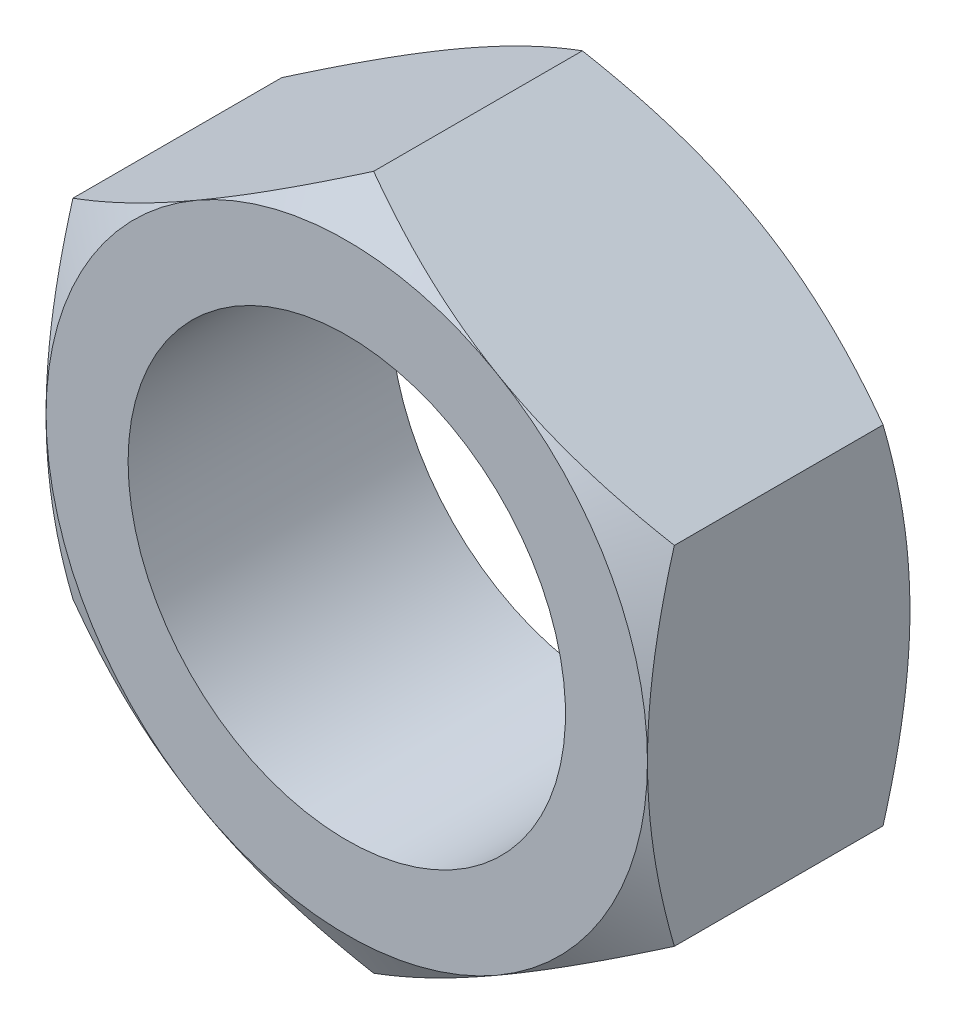
ISO-10303-21;
HEADER;
FILE_DESCRIPTION(('STEP AP214'),'2;1');
FILE_NAME('part.step','',(''),(''),'','','');
FILE_SCHEMA(('AUTOMOTIVE_DESIGN { 1 0 10303 214 1 1 1 1 }'));
ENDSEC;
DATA;
#1=APPLICATION_CONTEXT('core data for automotive mechanical design processes');
#2=APPLICATION_PROTOCOL_DEFINITION('international standard','automotive_design',2000,#1);
#3=PRODUCT_CONTEXT('',#1,'mechanical');
#4=PRODUCT('Part','Part','',(#3));
#5=PRODUCT_RELATED_PRODUCT_CATEGORY('part','',(#4));
#6=PRODUCT_DEFINITION_FORMATION('','',#4);
#7=PRODUCT_DEFINITION_CONTEXT('part definition',#1,'design');
#8=PRODUCT_DEFINITION('design','',#6,#7);
#9=PRODUCT_DEFINITION_SHAPE('','',#8);
#10=(LENGTH_UNIT() NAMED_UNIT(*) SI_UNIT(.MILLI.,.METRE.));
#11=(NAMED_UNIT(*) PLANE_ANGLE_UNIT() SI_UNIT($,.RADIAN.));
#12=(NAMED_UNIT(*) SI_UNIT($,.STERADIAN.) SOLID_ANGLE_UNIT());
#13=UNCERTAINTY_MEASURE_WITH_UNIT(LENGTH_MEASURE(1.E-05),#10,'distance_accuracy_value','');
#14=(GEOMETRIC_REPRESENTATION_CONTEXT(3) GLOBAL_UNCERTAINTY_ASSIGNED_CONTEXT((#13)) GLOBAL_UNIT_ASSIGNED_CONTEXT((#10,
#11,#12)) REPRESENTATION_CONTEXT('',''));
#15=CARTESIAN_POINT('',(0.,0.,0.));
#16=DIRECTION('',(0.,0.,1.));
#17=DIRECTION('',(1.,0.,0.));
#18=AXIS2_PLACEMENT_3D('',#15,#16,#17);
#19=CARTESIAN_POINT('',(0.,3.17542648054295,-2.4));
#20=DIRECTION('',(0.,0.,-1.));
#21=DIRECTION('',(-1.,0.,0.));
#22=AXIS2_PLACEMENT_3D('',#19,#20,#21);
#23=PLANE('',#22);
#24=CARTESIAN_POINT('',(0.,0.,-2.4));
#25=DIRECTION('',(0.,0.,-1.));
#26=DIRECTION('',(-1.,0.,0.));
#27=AXIS2_PLACEMENT_3D('',#24,#25,#26);
#28=CIRCLE('',#27,2.);
#29=CARTESIAN_POINT('',(-2.,0.,-2.4));
#30=VERTEX_POINT('',#29);
#31=EDGE_CURVE('E326',#30,#30,#28,.T.);
#32=ORIENTED_EDGE('',*,*,#31,.F.);
#33=EDGE_LOOP('',(#32));
#34=FACE_BOUND('',#33,.T.);
#35=CARTESIAN_POINT('',(0.,0.,-2.4));
#36=DIRECTION('',(0.,0.,-1.));
#37=DIRECTION('',(-1.,0.,0.));
#38=AXIS2_PLACEMENT_3D('',#35,#36,#37);
#39=CIRCLE('',#38,2.75);
#40=CARTESIAN_POINT('',(-2.75,0.,-2.4));
#41=VERTEX_POINT('',#40);
#42=CARTESIAN_POINT('',(-1.37500000000002,-2.3815698604072,-2.4));
#43=VERTEX_POINT('',#42);
#44=EDGE_CURVE('E180',#41,#43,#39,.F.);
#45=ORIENTED_EDGE('',*,*,#44,.F.);
#46=CARTESIAN_POINT('',(-1.37500000000001,2.3815698604072,-2.4));
#47=VERTEX_POINT('',#46);
#48=EDGE_CURVE('E162',#47,#41,#39,.F.);
#49=ORIENTED_EDGE('',*,*,#48,.F.);
#50=CARTESIAN_POINT('',(1.37500000000002,2.38156986040719,-2.4));
#51=VERTEX_POINT('',#50);
#52=EDGE_CURVE('E179',#51,#47,#39,.F.);
#53=ORIENTED_EDGE('',*,*,#52,.F.);
#54=CARTESIAN_POINT('',(0.,0.,-2.4));
#55=DIRECTION('',(0.,0.,1.));
#56=DIRECTION('',(1.,0.,0.));
#57=AXIS2_PLACEMENT_3D('',#54,#55,#56);
#58=CIRCLE('',#57,2.75);
#59=CARTESIAN_POINT('',(2.75,0.,-2.4));
#60=VERTEX_POINT('',#59);
#61=EDGE_CURVE('E314',#60,#51,#58,.T.);
#62=ORIENTED_EDGE('',*,*,#61,.F.);
#63=CARTESIAN_POINT('',(1.375,-2.3815698604072,-2.4));
#64=VERTEX_POINT('',#63);
#65=EDGE_CURVE('E194',#64,#60,#39,.F.);
#66=ORIENTED_EDGE('',*,*,#65,.F.);
#67=EDGE_CURVE('E189',#43,#64,#39,.F.);
#68=ORIENTED_EDGE('',*,*,#67,.F.);
#69=EDGE_LOOP('',(#45,#49,#53,#62,#66,#68));
#70=FACE_BOUND('',#69,.T.);
#71=ADVANCED_FACE('F45',(#34,#70),#23,.T.);
#72=CARTESIAN_POINT('',(0.,3.17542648054295,0.));
#73=DIRECTION('',(0.,0.,-1.));
#74=DIRECTION('',(-1.,0.,0.));
#75=AXIS2_PLACEMENT_3D('',#72,#73,#74);
#76=PLANE('',#75);
#77=CARTESIAN_POINT('',(0.,0.,0.));
#78=DIRECTION('',(0.,0.,-1.));
#79=DIRECTION('',(-1.,0.,0.));
#80=AXIS2_PLACEMENT_3D('',#77,#78,#79);
#81=CIRCLE('',#80,2.);
#82=CARTESIAN_POINT('',(-2.,0.,0.));
#83=VERTEX_POINT('',#82);
#84=EDGE_CURVE('E50',#83,#83,#81,.T.);
#85=ORIENTED_EDGE('',*,*,#84,.T.);
#86=EDGE_LOOP('',(#85));
#87=FACE_BOUND('',#86,.T.);
#88=CARTESIAN_POINT('',(0.,0.,0.));
#89=DIRECTION('',(0.,0.,-1.));
#90=DIRECTION('',(-1.,0.,0.));
#91=AXIS2_PLACEMENT_3D('',#88,#89,#90);
#92=CIRCLE('',#91,2.75);
#93=CARTESIAN_POINT('',(-2.75,0.,0.));
#94=VERTEX_POINT('',#93);
#95=CARTESIAN_POINT('',(-1.37500000000001,2.3815698604072,0.));
#96=VERTEX_POINT('',#95);
#97=EDGE_CURVE('E11',#94,#96,#92,.T.);
#98=ORIENTED_EDGE('',*,*,#97,.F.);
#99=CARTESIAN_POINT('',(-1.37500000000002,-2.3815698604072,0.));
#100=VERTEX_POINT('',#99);
#101=EDGE_CURVE('E56',#100,#94,#92,.T.);
#102=ORIENTED_EDGE('',*,*,#101,.F.);
#103=CARTESIAN_POINT('',(1.375,-2.3815698604072,0.));
#104=VERTEX_POINT('',#103);
#105=EDGE_CURVE('E182',#104,#100,#92,.T.);
#106=ORIENTED_EDGE('',*,*,#105,.F.);
#107=CARTESIAN_POINT('',(2.75,0.,0.));
#108=VERTEX_POINT('',#107);
#109=EDGE_CURVE('E187',#108,#104,#92,.T.);
#110=ORIENTED_EDGE('',*,*,#109,.F.);
#111=CARTESIAN_POINT('',(0.,0.,0.));
#112=DIRECTION('',(0.,0.,1.));
#113=DIRECTION('',(1.,0.,0.));
#114=AXIS2_PLACEMENT_3D('',#111,#112,#113);
#115=CIRCLE('',#114,2.75);
#116=CARTESIAN_POINT('',(1.37500000000002,2.38156986040719,0.));
#117=VERTEX_POINT('',#116);
#118=EDGE_CURVE('E138',#108,#117,#115,.T.);
#119=ORIENTED_EDGE('',*,*,#118,.T.);
#120=EDGE_CURVE('E55',#96,#117,#92,.T.);
#121=ORIENTED_EDGE('',*,*,#120,.F.);
#122=EDGE_LOOP('',(#98,#102,#106,#110,#119,#121));
#123=FACE_BOUND('',#122,.T.);
#124=ADVANCED_FACE('F248',(#87,#123),#76,.F.);
#125=CARTESIAN_POINT('',(0.,3.17542648054295,-2.4));
#126=DIRECTION('',(-0.500000000000004,0.866025403784436,0.));
#127=DIRECTION('',(-0.866025403784437,-0.500000000000004,0.));
#128=AXIS2_PLACEMENT_3D('',#125,#126,#127);
#129=PLANE('',#128);
#130=DIRECTION('',(0.,0.,1.));
#131=VECTOR('',#130,1.);
#132=CARTESIAN_POINT('',(-2.75,1.58771324027146,-2.4));
#133=LINE('',#132,#131);
#134=CARTESIAN_POINT('',(-2.75,1.58771324027149,-2.15437990693813));
#135=VERTEX_POINT('',#134);
#136=CARTESIAN_POINT('',(-2.75,1.58771324027146,-0.245620093061863));
#137=VERTEX_POINT('',#136);
#138=EDGE_CURVE('E174',#135,#137,#133,.T.);
#139=ORIENTED_EDGE('',*,*,#138,.T.);
#140=CARTESIAN_POINT('',(-2.7502,1.58759777021762,-0.245686763364762));
#141=CARTESIAN_POINT('',(-2.62935077934009,1.65737010029698,-0.205387662249264));
#142=CARTESIAN_POINT('',(-2.50745839737737,1.72774469983532,-0.168736902597662));
#143=CARTESIAN_POINT('',(-2.26156287327211,1.86971254687002,-0.1047621829698));
#144=CARTESIAN_POINT('',(-2.13755536142614,1.94130831721582,-0.0774608556744958));
#145=CARTESIAN_POINT('',(-1.89107720202406,2.08361254889598,-0.0349617452941147));
#146=CARTESIAN_POINT('',(-1.76864448141258,2.15429911309863,-0.0194811186224557));
#147=CARTESIAN_POINT('',(-1.52320285763109,2.29600490065922,-0.000999397369938647));
#148=CARTESIAN_POINT('',(-1.40019484676709,2.36702360884403,0.00201700053740192));
#149=CARTESIAN_POINT('',(-1.17034121338921,2.49972966594897,-0.0042531454285456));
#150=CARTESIAN_POINT('',(-1.06346120874598,2.56143686540072,-0.0120001542767017));
#151=CARTESIAN_POINT('',(-0.850397532665248,2.68444923614047,-0.0365551810643555));
#152=CARTESIAN_POINT('',(-0.744214598351108,2.74575398185008,-0.0533715896505721));
#153=CARTESIAN_POINT('',(-0.530711510606812,2.86902004703207,-0.0954119223459602));
#154=CARTESIAN_POINT('',(-0.423418383857139,2.93096576264319,-0.120814080687236));
#155=CARTESIAN_POINT('',(-0.210432520715941,3.05393320806134,-0.178467225839989));
#156=CARTESIAN_POINT('',(-0.104737054973339,3.11495651365996,-0.210704663298991));
#157=CARTESIAN_POINT('',(0.000200000000009052,3.17554195059679,-0.245686763364771));
#158=B_SPLINE_CURVE_WITH_KNOTS('',3,(#140,#141,#142,#143,#144,#145,#146,#147,#148,#149,#150,
#151,#152,#153,#154,#155,#156,#157),.UNSPECIFIED.,.F.,.F.,(4,2,2,2,2,2,2,2,4),(0.,
0.435912828725888,0.872873557116333,1.29901931904672,1.72464171213574,2.09526089052938,
2.46622354066375,2.84541551798559,3.22386274754526),.UNSPECIFIED.);
#159=EDGE_CURVE('E143',#137,#96,#158,.T.);
#160=ORIENTED_EDGE('',*,*,#159,.T.);
#161=CARTESIAN_POINT('',(0.,3.17542648054295,-0.245620093061873));
#162=VERTEX_POINT('',#161);
#163=EDGE_CURVE('E63',#96,#162,#158,.T.);
#164=ORIENTED_EDGE('',*,*,#163,.T.);
#165=DIRECTION('',(0.,0.,1.));
#166=VECTOR('',#165,1.);
#167=CARTESIAN_POINT('',(0.,3.17542648054295,-2.4));
#168=LINE('',#167,#166);
#169=CARTESIAN_POINT('',(0.,3.17542648054295,-2.15437990693813));
#170=VERTEX_POINT('',#169);
#171=EDGE_CURVE('E159',#170,#162,#168,.T.);
#172=ORIENTED_EDGE('',*,*,#171,.F.);
#173=CARTESIAN_POINT('',(-2.7502,1.58759777021762,-2.15431323663524));
#174=CARTESIAN_POINT('',(-2.62935077934009,1.65737010029698,-2.19461233775074));
#175=CARTESIAN_POINT('',(-2.50745839737737,1.72774469983532,-2.23126309740234));
#176=CARTESIAN_POINT('',(-2.26156287327211,1.86971254687002,-2.2952378170302));
#177=CARTESIAN_POINT('',(-2.13755536142614,1.94130831721582,-2.3225391443255));
#178=CARTESIAN_POINT('',(-1.89107720202406,2.08361254889598,-2.36503825470588));
#179=CARTESIAN_POINT('',(-1.76864448141258,2.15429911309863,-2.38051888137754));
#180=CARTESIAN_POINT('',(-1.52320285763109,2.29600490065922,-2.39900060263006));
#181=CARTESIAN_POINT('',(-1.40019484676709,2.36702360884403,-2.4020170005374));
#182=CARTESIAN_POINT('',(-1.17034121338921,2.49972966594897,-2.39574685457145));
#183=CARTESIAN_POINT('',(-1.06346120874598,2.56143686540072,-2.3879998457233));
#184=CARTESIAN_POINT('',(-0.850397532665248,2.68444923614047,-2.36344481893564));
#185=CARTESIAN_POINT('',(-0.744214598351108,2.74575398185008,-2.34662841034943));
#186=CARTESIAN_POINT('',(-0.530711510606812,2.86902004703207,-2.30458807765404));
#187=CARTESIAN_POINT('',(-0.423418383857139,2.93096576264319,-2.27918591931276));
#188=CARTESIAN_POINT('',(-0.210432520715941,3.05393320806134,-2.22153277416001));
#189=CARTESIAN_POINT('',(-0.104737054973339,3.11495651365996,-2.18929533670101));
#190=CARTESIAN_POINT('',(0.00020000000000905,3.17554195059679,-2.15431323663523));
#191=B_SPLINE_CURVE_WITH_KNOTS('',3,(#173,#174,#175,#176,#177,#178,#179,#180,#181,#182,#183,
#184,#185,#186,#187,#188,#189,#190),.UNSPECIFIED.,.F.,.F.,(4,2,2,2,2,2,2,2,4),(0.,
0.435912828725889,0.872873557116333,1.29901931904672,1.72464171213574,2.09526089052938,
2.46622354066375,2.84541551798559,3.22386274754526),.UNSPECIFIED.);
#192=EDGE_CURVE('E177',#47,#170,#191,.T.);
#193=ORIENTED_EDGE('',*,*,#192,.F.);
#194=EDGE_CURVE('E212',#135,#47,#191,.T.);
#195=ORIENTED_EDGE('',*,*,#194,.F.);
#196=EDGE_LOOP('',(#139,#160,#164,#172,#193,#195));
#197=FACE_BOUND('',#196,.T.);
#198=ADVANCED_FACE('F47',(#197),#129,.T.);
#199=CARTESIAN_POINT('',(2.75,1.58771324027145,-2.4));
#200=DIRECTION('',(0.500000000000009,0.866025403784433,0.));
#201=DIRECTION('',(-0.866025403784434,0.500000000000009,0.));
#202=AXIS2_PLACEMENT_3D('',#199,#200,#201);
#203=PLANE('',#202);
#204=ORIENTED_EDGE('',*,*,#171,.T.);
#205=CARTESIAN_POINT('',(-0.000199999999990853,3.17554195059679,-0.245686763364771));
#206=CARTESIAN_POINT('',(0.120649220659915,3.10576962051743,-0.205387662249272));
#207=CARTESIAN_POINT('',(0.242541602622642,3.03539502097909,-0.16873690259767));
#208=CARTESIAN_POINT('',(0.488437126727901,2.89342717394439,-0.104762182969806));
#209=CARTESIAN_POINT('',(0.612444638573863,2.82183140359859,-0.0774608556745011));
#210=CARTESIAN_POINT('',(0.858922797975952,2.67952717191842,-0.0349617452941182));
#211=CARTESIAN_POINT('',(0.981355518587425,2.60884060771577,-0.0194811186224581));
#212=CARTESIAN_POINT('',(1.22679714236892,2.46713482015518,-0.000999397369939154));
#213=CARTESIAN_POINT('',(1.34980515323292,2.39611611197037,0.00201700053740218));
#214=CARTESIAN_POINT('',(1.5796587866108,2.26341005486543,-0.00425314542854392));
#215=CARTESIAN_POINT('',(1.68653879125403,2.20170285541367,-0.0120001542766992));
#216=CARTESIAN_POINT('',(1.89960246733476,2.07869048467393,-0.0365551810643514));
#217=CARTESIAN_POINT('',(2.00578540164889,2.01738573896432,-0.053371589650567));
#218=CARTESIAN_POINT('',(2.21928848939319,1.89411967378233,-0.0954119223459534));
#219=CARTESIAN_POINT('',(2.32658161614286,1.83217395817121,-0.120814080687228));
#220=CARTESIAN_POINT('',(2.53956747928405,1.70920651275305,-0.17846722583998));
#221=CARTESIAN_POINT('',(2.64526294502666,1.64818320715444,-0.210704663298981));
#222=CARTESIAN_POINT('',(2.7502,1.58759777021761,-0.245686763364759));
#223=B_SPLINE_CURVE_WITH_KNOTS('',3,(#205,#206,#207,#208,#209,#210,#211,#212,#213,#214,#215,
#216,#217,#218,#219,#220,#221,#222),.UNSPECIFIED.,.F.,.F.,(4,2,2,2,2,2,2,2,4),(0.,
0.435912828725891,0.872873557116338,1.29901931904672,1.72464171213575,2.09526089052939,
2.46622354066375,2.84541551798559,3.22386274754526),.UNSPECIFIED.);
#224=EDGE_CURVE('E153',#162,#117,#223,.T.);
#225=ORIENTED_EDGE('',*,*,#224,.T.);
#226=CARTESIAN_POINT('',(2.75,1.58771324027149,-0.245620093061873));
#227=VERTEX_POINT('',#226);
#228=EDGE_CURVE('E70',#117,#227,#223,.T.);
#229=ORIENTED_EDGE('',*,*,#228,.T.);
#230=DIRECTION('',(0.,0.,1.));
#231=VECTOR('',#230,1.);
#232=CARTESIAN_POINT('',(2.75,1.58771324027145,-2.4));
#233=LINE('',#232,#231);
#234=CARTESIAN_POINT('',(2.75,1.58771324027149,-2.15437990693813));
#235=VERTEX_POINT('',#234);
#236=EDGE_CURVE('E152',#235,#227,#233,.T.);
#237=ORIENTED_EDGE('',*,*,#236,.F.);
#238=CARTESIAN_POINT('',(-0.000199999999990853,3.17554195059679,-2.15431323663523));
#239=CARTESIAN_POINT('',(0.120649220659915,3.10576962051743,-2.19461233775073));
#240=CARTESIAN_POINT('',(0.242541602622642,3.03539502097909,-2.23126309740233));
#241=CARTESIAN_POINT('',(0.488437126727901,2.89342717394439,-2.29523781703019));
#242=CARTESIAN_POINT('',(0.612444638573863,2.82183140359859,-2.3225391443255));
#243=CARTESIAN_POINT('',(0.858922797975952,2.67952717191842,-2.36503825470588));
#244=CARTESIAN_POINT('',(0.981355518587425,2.60884060771577,-2.38051888137754));
#245=CARTESIAN_POINT('',(1.22679714236892,2.46713482015518,-2.39900060263006));
#246=CARTESIAN_POINT('',(1.34980515323292,2.39611611197037,-2.4020170005374));
#247=CARTESIAN_POINT('',(1.5796587866108,2.26341005486543,-2.39574685457146));
#248=CARTESIAN_POINT('',(1.68653879125403,2.20170285541367,-2.3879998457233));
#249=CARTESIAN_POINT('',(1.89960246733476,2.07869048467393,-2.36344481893565));
#250=CARTESIAN_POINT('',(2.00578540164889,2.01738573896432,-2.34662841034943));
#251=CARTESIAN_POINT('',(2.21928848939319,1.89411967378233,-2.30458807765405));
#252=CARTESIAN_POINT('',(2.32658161614286,1.83217395817121,-2.27918591931277));
#253=CARTESIAN_POINT('',(2.53956747928406,1.70920651275305,-2.22153277416002));
#254=CARTESIAN_POINT('',(2.64526294502666,1.64818320715444,-2.18929533670102));
#255=CARTESIAN_POINT('',(2.7502,1.58759777021761,-2.15431323663524));
#256=B_SPLINE_CURVE_WITH_KNOTS('',3,(#238,#239,#240,#241,#242,#243,#244,#245,#246,#247,#248,
#249,#250,#251,#252,#253,#254,#255),.UNSPECIFIED.,.F.,.F.,(4,2,2,2,2,2,2,2,4),(0.,
0.435912828725891,0.872873557116338,1.29901931904672,1.72464171213575,2.09526089052939,
2.46622354066375,2.84541551798559,3.22386274754526),.UNSPECIFIED.);
#257=EDGE_CURVE('E221',#51,#235,#256,.T.);
#258=ORIENTED_EDGE('',*,*,#257,.F.);
#259=EDGE_CURVE('E206',#170,#51,#256,.T.);
#260=ORIENTED_EDGE('',*,*,#259,.F.);
#261=EDGE_LOOP('',(#204,#225,#229,#237,#258,#260));
#262=FACE_BOUND('',#261,.T.);
#263=ADVANCED_FACE('F150',(#262),#203,.T.);
#264=CARTESIAN_POINT('',(2.75,1.58771324027145,-2.4));
#265=DIRECTION('',(-1.,0.,0.));
#266=DIRECTION('',(0.,0.,1.));
#267=AXIS2_PLACEMENT_3D('',#264,#265,#266);
#268=PLANE('',#267);
#269=CARTESIAN_POINT('',(2.75,-4.2108494930968,-1.31594843960298));
#270=CARTESIAN_POINT('',(2.75,-4.09010894214094,-1.25759993615228));
#271=CARTESIAN_POINT('',(2.75,-3.96908292065513,-1.19983146511762));
#272=CARTESIAN_POINT('',(2.75,-3.72630558284848,-1.08578603842309));
#273=CARTESIAN_POINT('',(2.75,-3.60455414536204,-1.02950934100251));
#274=CARTESIAN_POINT('',(2.75,-3.35951393034358,-0.91848244335279));
#275=CARTESIAN_POINT('',(2.75,-3.2362203423644,-0.86374282160587));
#276=CARTESIAN_POINT('',(2.75,-2.98861980138747,-0.756614777476483));
#277=CARTESIAN_POINT('',(2.75,-2.86431290161186,-0.704226232536791));
#278=CARTESIAN_POINT('',(2.75,-2.61294485887175,-0.601803572146148));
#279=CARTESIAN_POINT('',(2.75,-2.48586863815658,-0.551806257898417));
#280=CARTESIAN_POINT('',(2.75,-2.23021732171544,-0.455727408784622));
#281=CARTESIAN_POINT('',(2.75,-2.10164206103367,-0.409646309576991));
#282=CARTESIAN_POINT('',(2.75,-1.8430521879947,-0.322638077046248));
#283=CARTESIAN_POINT('',(2.75,-1.71304130052586,-0.281699986413904));
#284=CARTESIAN_POINT('',(2.75,-1.45117125062151,-0.206307307624361));
#285=CARTESIAN_POINT('',(2.75,-1.31931268690205,-0.171850669152779));
#286=CARTESIAN_POINT('',(2.75,-1.05365722480015,-0.111093671530913));
#287=CARTESIAN_POINT('',(2.75,-0.919859820217618,-0.0847954840951296));
#288=CARTESIAN_POINT('',(2.75,-0.650651874037407,-0.0421260371966173));
#289=CARTESIAN_POINT('',(2.75,-0.51524133101362,-0.0257547865105482));
#290=CARTESIAN_POINT('',(2.75,-0.244373242869234,-0.00438749654024083));
#291=CARTESIAN_POINT('',(2.75,-0.108921526377156,0.000680556773213286));
#292=CARTESIAN_POINT('',(2.75,0.161887058855113,-0.000827795632673346));
#293=CARTESIAN_POINT('',(2.75,0.297243943089621,-0.00740117868555447));
#294=CARTESIAN_POINT('',(2.75,0.528385436717521,-0.0281041300468438));
#295=CARTESIAN_POINT('',(2.75,0.624425050137477,-0.0395376410301878));
#296=CARTESIAN_POINT('',(2.75,0.815762399811515,-0.0675217196133493));
#297=CARTESIAN_POINT('',(2.75,0.911060016631936,-0.08407309422768));
#298=CARTESIAN_POINT('',(2.75,1.19576218748913,-0.14053536127828));
#299=CARTESIAN_POINT('',(2.75,1.38383224738492,-0.187239859417288));
#300=CARTESIAN_POINT('',(2.75,1.6652504894748,-0.26779249703057));
#301=CARTESIAN_POINT('',(2.75,1.76006556248553,-0.296803334995491));
#302=CARTESIAN_POINT('',(2.75,1.9487060938221,-0.357695648906576));
#303=CARTESIAN_POINT('',(2.75,2.0425321855369,-0.389575144878491));
#304=CARTESIAN_POINT('',(2.75,2.22880240354978,-0.455541418186435));
#305=CARTESIAN_POINT('',(2.75,2.32125133588445,-0.489614761455518));
#306=CARTESIAN_POINT('',(2.75,2.50543192042622,-0.559761368231093));
#307=CARTESIAN_POINT('',(2.75,2.59716326539572,-0.595835440037301));
#308=CARTESIAN_POINT('',(2.75,2.68856293053338,-0.632712441997466));
#309=B_SPLINE_CURVE_WITH_KNOTS('',3,(#269,#270,#271,#272,#273,#274,#275,#276,#277,#278,#279,
#280,#281,#282,#283,#284,#285,#286,#287,#288,#289,#290,#291,#292,#293,#294,#295,#296,#297,#298,
#299,#300,#301,#302,#303,#304,#305,#306,#307,#308),.UNSPECIFIED.,.F.,.F.,(4,2,2,2,2,2,2,2,2,2,2,
2,2,2,2,2,2,2,2,4),(0.,0.402305607365938,0.804680408537001,1.20935783819119,1.61401414820819,
2.02363838185771,2.4333081245735,2.84208969479602,3.25074173456638,3.65950246109146,
4.06826354901186,4.47441284024653,4.88045669141175,5.17046846817548,5.46052599902454,
6.04107275309883,6.33851131304661,6.63574613017454,6.9313079100579,7.2269899800482),.UNSPECIFIED.);
#310=CARTESIAN_POINT('',(2.74999999999999,-1.58771324027152,-0.245620093061873));
#311=VERTEX_POINT('',#310);
#312=EDGE_CURVE('E145',#311,#108,#309,.T.);
#313=ORIENTED_EDGE('',*,*,#312,.F.);
#314=DIRECTION('',(0.,0.,1.));
#315=VECTOR('',#314,1.);
#316=CARTESIAN_POINT('',(2.75,-1.58771324027151,-2.4));
#317=LINE('',#316,#315);
#318=CARTESIAN_POINT('',(2.74999999999999,-1.58771324027152,-2.15437990693813));
#319=VERTEX_POINT('',#318);
#320=EDGE_CURVE('E160',#319,#311,#317,.T.);
#321=ORIENTED_EDGE('',*,*,#320,.F.);
#322=CARTESIAN_POINT('',(2.75,-4.2108494930968,-1.08405156039702));
#323=CARTESIAN_POINT('',(2.75,-4.09010894214094,-1.14240006384772));
#324=CARTESIAN_POINT('',(2.75,-3.96908292065513,-1.20016853488238));
#325=CARTESIAN_POINT('',(2.75,-3.72630558284848,-1.31421396157691));
#326=CARTESIAN_POINT('',(2.75,-3.60455414536204,-1.37049065899749));
#327=CARTESIAN_POINT('',(2.75,-3.35951393034358,-1.48151755664721));
#328=CARTESIAN_POINT('',(2.75,-3.2362203423644,-1.53625717839413));
#329=CARTESIAN_POINT('',(2.75,-2.98861980138747,-1.64338522252352));
#330=CARTESIAN_POINT('',(2.75,-2.86431290161186,-1.69577376746321));
#331=CARTESIAN_POINT('',(2.75,-2.61294485887176,-1.79819642785385));
#332=CARTESIAN_POINT('',(2.75,-2.48586863815658,-1.84819374210158));
#333=CARTESIAN_POINT('',(2.75,-2.23021732171544,-1.94427259121538));
#334=CARTESIAN_POINT('',(2.75,-2.10164206103367,-1.99035369042301));
#335=CARTESIAN_POINT('',(2.75,-1.8430521879947,-2.07736192295375));
#336=CARTESIAN_POINT('',(2.75,-1.71304130052586,-2.1183000135861));
#337=CARTESIAN_POINT('',(2.75,-1.45117125062151,-2.19369269237564));
#338=CARTESIAN_POINT('',(2.75,-1.31931268690205,-2.22814933084722));
#339=CARTESIAN_POINT('',(2.75,-1.05365722480015,-2.28890632846909));
#340=CARTESIAN_POINT('',(2.75,-0.919859820217618,-2.31520451590487));
#341=CARTESIAN_POINT('',(2.75,-0.650651874037407,-2.35787396280338));
#342=CARTESIAN_POINT('',(2.75,-0.515241331013619,-2.37424521348945));
#343=CARTESIAN_POINT('',(2.75,-0.244373242869234,-2.39561250345976));
#344=CARTESIAN_POINT('',(2.75,-0.108921526377155,-2.40068055677321));
#345=CARTESIAN_POINT('',(2.75,0.161887058855114,-2.39917220436733));
#346=CARTESIAN_POINT('',(2.75,0.297243943089621,-2.39259882131445));
#347=CARTESIAN_POINT('',(2.75,0.528385436717521,-2.37189586995316));
#348=CARTESIAN_POINT('',(2.75,0.624425050137477,-2.36046235896981));
#349=CARTESIAN_POINT('',(2.75,0.815762399811515,-2.33247828038665));
#350=CARTESIAN_POINT('',(2.75,0.911060016631935,-2.31592690577232));
#351=CARTESIAN_POINT('',(2.75,1.19576218748913,-2.25946463872172));
#352=CARTESIAN_POINT('',(2.75,1.38383224738492,-2.21276014058271));
#353=CARTESIAN_POINT('',(2.75,1.6652504894748,-2.13220750296943));
#354=CARTESIAN_POINT('',(2.75,1.76006556248553,-2.10319666500451));
#355=CARTESIAN_POINT('',(2.75,1.9487060938221,-2.04230435109342));
#356=CARTESIAN_POINT('',(2.75,2.0425321855369,-2.01042485512151));
#357=CARTESIAN_POINT('',(2.75,2.22880240354978,-1.94445858181357));
#358=CARTESIAN_POINT('',(2.75,2.32125133588445,-1.91038523854448));
#359=CARTESIAN_POINT('',(2.75,2.50543192042622,-1.84023863176891));
#360=CARTESIAN_POINT('',(2.75,2.59716326539572,-1.8041645599627));
#361=CARTESIAN_POINT('',(2.75,2.68856293053338,-1.76728755800253));
#362=B_SPLINE_CURVE_WITH_KNOTS('',3,(#322,#323,#324,#325,#326,#327,#328,#329,#330,#331,#332,
#333,#334,#335,#336,#337,#338,#339,#340,#341,#342,#343,#344,#345,#346,#347,#348,#349,#350,#351,
#352,#353,#354,#355,#356,#357,#358,#359,#360,#361),.UNSPECIFIED.,.F.,.F.,(4,2,2,2,2,2,2,2,2,2,2,
2,2,2,2,2,2,2,2,4),(0.,0.402305607365938,0.804680408537,1.20935783819119,1.61401414820819,
2.02363838185771,2.4333081245735,2.84208969479602,3.25074173456638,3.65950246109146,
4.06826354901186,4.47441284024653,4.88045669141175,5.17046846817548,5.46052599902454,
6.04107275309883,6.33851131304661,6.63574613017454,6.9313079100579,7.2269899800482),.UNSPECIFIED.);
#363=EDGE_CURVE('E218',#319,#60,#362,.T.);
#364=ORIENTED_EDGE('',*,*,#363,.T.);
#365=EDGE_CURVE('E158',#60,#235,#362,.T.);
#366=ORIENTED_EDGE('',*,*,#365,.T.);
#367=ORIENTED_EDGE('',*,*,#236,.T.);
#368=EDGE_CURVE('E135',#108,#227,#309,.T.);
#369=ORIENTED_EDGE('',*,*,#368,.F.);
#370=EDGE_LOOP('',(#313,#321,#364,#366,#367,#369));
#371=FACE_BOUND('',#370,.T.);
#372=ADVANCED_FACE('F156',(#371),#268,.F.);
#373=CARTESIAN_POINT('',(0.,-3.17542648054299,-2.4));
#374=DIRECTION('',(0.500000000000002,-0.866025403784438,0.));
#375=DIRECTION('',(0.866025403784438,0.500000000000002,0.));
#376=AXIS2_PLACEMENT_3D('',#373,#374,#375);
#377=PLANE('',#376);
#378=ORIENTED_EDGE('',*,*,#320,.T.);
#379=CARTESIAN_POINT('',(2.7502,-1.58759777021767,-0.245686763364776));
#380=CARTESIAN_POINT('',(2.6293507793401,-1.65737010029702,-0.205387662249279));
#381=CARTESIAN_POINT('',(2.50745839737737,-1.72774469983537,-0.168736902597678));
#382=CARTESIAN_POINT('',(2.26156287327211,-1.86971254687006,-0.104762182969816));
#383=CARTESIAN_POINT('',(2.13755536142614,-1.94130831721587,-0.0774608556745132));
#384=CARTESIAN_POINT('',(1.89107720202405,-2.08361254889603,-0.0349617452941333));
#385=CARTESIAN_POINT('',(1.76864448141258,-2.15429911309868,-0.0194811186224748));
#386=CARTESIAN_POINT('',(1.52320285763108,-2.29600490065927,-0.000999397369959041));
#387=CARTESIAN_POINT('',(1.40019484676708,-2.36702360884408,0.00201700053738056));
#388=CARTESIAN_POINT('',(1.1703412133892,-2.49972966594901,-0.00425314542856851));
#389=CARTESIAN_POINT('',(1.06346120874597,-2.56143686540077,-0.012000154276725));
#390=CARTESIAN_POINT('',(0.850397532665243,-2.68444923614051,-0.0365551810643791));
#391=CARTESIAN_POINT('',(0.744214598351104,-2.74575398185012,-0.0533715896505955));
#392=CARTESIAN_POINT('',(0.530711510606811,-2.86902004703211,-0.0954119223459832));
#393=CARTESIAN_POINT('',(0.42341838385714,-2.93096576264323,-0.120814080687258));
#394=CARTESIAN_POINT('',(0.210432520715946,-3.05393320806138,-0.178467225840011));
#395=CARTESIAN_POINT('',(0.104737054973345,-3.11495651366,-0.210704663299012));
#396=CARTESIAN_POINT('',(-0.000200000000002151,-3.17554195059682,-0.245686763364791));
#397=B_SPLINE_CURVE_WITH_KNOTS('',3,(#379,#380,#381,#382,#383,#384,#385,#386,#387,#388,#389,
#390,#391,#392,#393,#394,#395,#396),.UNSPECIFIED.,.F.,.F.,(4,2,2,2,2,2,2,2,4),(0.,
0.435912828725892,0.872873557116341,1.29901931904673,1.72464171213575,2.09526089052939,
2.46622354066376,2.84541551798558,3.22386274754525),.UNSPECIFIED.);
#398=EDGE_CURVE('E292',#311,#104,#397,.T.);
#399=ORIENTED_EDGE('',*,*,#398,.T.);
#400=CARTESIAN_POINT('',(0.,-3.17542648054295,-0.245620093061873));
#401=VERTEX_POINT('',#400);
#402=EDGE_CURVE('E285',#104,#401,#397,.T.);
#403=ORIENTED_EDGE('',*,*,#402,.T.);
#404=DIRECTION('',(0.,0.,1.));
#405=VECTOR('',#404,1.);
#406=CARTESIAN_POINT('',(0.,-3.17542648054299,-2.4));
#407=LINE('',#406,#405);
#408=CARTESIAN_POINT('',(0.,-3.17542648054295,-2.15437990693813));
#409=VERTEX_POINT('',#408);
#410=EDGE_CURVE('E165',#409,#401,#407,.T.);
#411=ORIENTED_EDGE('',*,*,#410,.F.);
#412=CARTESIAN_POINT('',(2.7502,-1.58759777021767,-2.15431323663522));
#413=CARTESIAN_POINT('',(2.6293507793401,-1.65737010029702,-2.19461233775072));
#414=CARTESIAN_POINT('',(2.50745839737737,-1.72774469983537,-2.23126309740232));
#415=CARTESIAN_POINT('',(2.26156287327211,-1.86971254687006,-2.29523781703018));
#416=CARTESIAN_POINT('',(2.13755536142614,-1.94130831721587,-2.32253914432549));
#417=CARTESIAN_POINT('',(1.89107720202405,-2.08361254889603,-2.36503825470587));
#418=CARTESIAN_POINT('',(1.76864448141258,-2.15429911309868,-2.38051888137752));
#419=CARTESIAN_POINT('',(1.52320285763108,-2.29600490065927,-2.39900060263004));
#420=CARTESIAN_POINT('',(1.40019484676708,-2.36702360884408,-2.40201700053738));
#421=CARTESIAN_POINT('',(1.1703412133892,-2.49972966594901,-2.39574685457143));
#422=CARTESIAN_POINT('',(1.06346120874597,-2.56143686540077,-2.38799984572327));
#423=CARTESIAN_POINT('',(0.850397532665243,-2.68444923614051,-2.36344481893562));
#424=CARTESIAN_POINT('',(0.744214598351104,-2.74575398185012,-2.3466284103494));
#425=CARTESIAN_POINT('',(0.530711510606811,-2.86902004703211,-2.30458807765402));
#426=CARTESIAN_POINT('',(0.42341838385714,-2.93096576264323,-2.27918591931274));
#427=CARTESIAN_POINT('',(0.210432520715945,-3.05393320806138,-2.22153277415999));
#428=CARTESIAN_POINT('',(0.104737054973345,-3.11495651366,-2.18929533670099));
#429=CARTESIAN_POINT('',(-0.00020000000000216,-3.17554195059682,-2.15431323663521));
#430=B_SPLINE_CURVE_WITH_KNOTS('',3,(#412,#413,#414,#415,#416,#417,#418,#419,#420,#421,#422,
#423,#424,#425,#426,#427,#428,#429),.UNSPECIFIED.,.F.,.F.,(4,2,2,2,2,2,2,2,4),(0.,
0.435912828725892,0.872873557116341,1.29901931904673,1.72464171213575,2.09526089052939,
2.46622354066376,2.84541551798558,3.22386274754525),.UNSPECIFIED.);
#431=EDGE_CURVE('E268',#64,#409,#430,.T.);
#432=ORIENTED_EDGE('',*,*,#431,.F.);
#433=EDGE_CURVE('E274',#319,#64,#430,.T.);
#434=ORIENTED_EDGE('',*,*,#433,.F.);
#435=EDGE_LOOP('',(#378,#399,#403,#411,#432,#434));
#436=FACE_BOUND('',#435,.T.);
#437=ADVANCED_FACE('F276',(#436),#377,.T.);
#438=CARTESIAN_POINT('',(-2.75,-1.58771324027149,-2.4));
#439=DIRECTION('',(-0.500000000000006,-0.866025403784435,0.));
#440=DIRECTION('',(0.866025403784435,-0.500000000000006,0.));
#441=AXIS2_PLACEMENT_3D('',#438,#439,#440);
#442=PLANE('',#441);
#443=ORIENTED_EDGE('',*,*,#410,.T.);
#444=CARTESIAN_POINT('',(0.000199999999997729,-3.17554195059682,-0.245686763364791));
#445=CARTESIAN_POINT('',(-0.12064922065991,-3.10576962051747,-0.205387662249292));
#446=CARTESIAN_POINT('',(-0.242541602622639,-3.03539502097912,-0.168736902597689));
#447=CARTESIAN_POINT('',(-0.488437126727901,-2.89342717394442,-0.104762182969825));
#448=CARTESIAN_POINT('',(-0.612444638573865,-2.82183140359862,-0.0774608556745198));
#449=CARTESIAN_POINT('',(-0.858922797975956,-2.67952717191845,-0.0349617452941368));
#450=CARTESIAN_POINT('',(-0.981355518587431,-2.6088406077158,-0.0194811186224767));
#451=CARTESIAN_POINT('',(-1.22679714236893,-2.46713482015521,-0.000999397369957624));
#452=CARTESIAN_POINT('',(-1.34980515323293,-2.3961161119704,0.00201700053738383));
#453=CARTESIAN_POINT('',(-1.57965878661081,-2.26341005486546,-0.00425314542856253));
#454=CARTESIAN_POINT('',(-1.68653879125404,-2.20170285541371,-0.0120001542767179));
#455=CARTESIAN_POINT('',(-1.89960246733476,-2.07869048467397,-0.0365551810643694));
#456=CARTESIAN_POINT('',(-2.0057854016489,-2.01738573896435,-0.0533715896505844));
#457=CARTESIAN_POINT('',(-2.21928848939319,-1.89411967378237,-0.0954119223459693));
#458=CARTESIAN_POINT('',(-2.32658161614286,-1.83217395817125,-0.120814080687243));
#459=CARTESIAN_POINT('',(-2.53956747928405,-1.7092065127531,-0.178467225839993));
#460=CARTESIAN_POINT('',(-2.64526294502665,-1.64818320715448,-0.210704663298993));
#461=CARTESIAN_POINT('',(-2.7502,-1.58759777021765,-0.24568676336477));
#462=B_SPLINE_CURVE_WITH_KNOTS('',3,(#444,#445,#446,#447,#448,#449,#450,#451,#452,#453,#454,
#455,#456,#457,#458,#459,#460,#461),.UNSPECIFIED.,.F.,.F.,(4,2,2,2,2,2,2,2,4),(0.,
0.435912828725896,0.872873557116347,1.29901931904674,1.72464171213576,2.0952608905294,
2.46622354066376,2.84541551798559,3.22386274754525),.UNSPECIFIED.);
#463=EDGE_CURVE('E293',#401,#100,#462,.T.);
#464=ORIENTED_EDGE('',*,*,#463,.T.);
#465=CARTESIAN_POINT('',(-2.75,-1.58771324027149,-0.245620093061873));
#466=VERTEX_POINT('',#465);
#467=EDGE_CURVE('E294',#100,#466,#462,.T.);
#468=ORIENTED_EDGE('',*,*,#467,.T.);
#469=DIRECTION('',(0.,0.,1.));
#470=VECTOR('',#469,1.);
#471=CARTESIAN_POINT('',(-2.75,-1.58771324027149,-2.4));
#472=LINE('',#471,#470);
#473=CARTESIAN_POINT('',(-2.75,-1.58771324027149,-2.15437990693813));
#474=VERTEX_POINT('',#473);
#475=EDGE_CURVE('E171',#474,#466,#472,.T.);
#476=ORIENTED_EDGE('',*,*,#475,.F.);
#477=CARTESIAN_POINT('',(0.000199999999997729,-3.17554195059682,-2.15431323663521));
#478=CARTESIAN_POINT('',(-0.120649220659909,-3.10576962051747,-2.19461233775071));
#479=CARTESIAN_POINT('',(-0.242541602622639,-3.03539502097912,-2.23126309740231));
#480=CARTESIAN_POINT('',(-0.488437126727901,-2.89342717394442,-2.29523781703017));
#481=CARTESIAN_POINT('',(-0.612444638573865,-2.82183140359862,-2.32253914432548));
#482=CARTESIAN_POINT('',(-0.858922797975956,-2.67952717191845,-2.36503825470586));
#483=CARTESIAN_POINT('',(-0.981355518587431,-2.6088406077158,-2.38051888137752));
#484=CARTESIAN_POINT('',(-1.22679714236893,-2.46713482015521,-2.39900060263004));
#485=CARTESIAN_POINT('',(-1.34980515323293,-2.3961161119704,-2.40201700053738));
#486=CARTESIAN_POINT('',(-1.57965878661081,-2.26341005486546,-2.39574685457144));
#487=CARTESIAN_POINT('',(-1.68653879125404,-2.20170285541371,-2.38799984572328));
#488=CARTESIAN_POINT('',(-1.89960246733476,-2.07869048467397,-2.36344481893563));
#489=CARTESIAN_POINT('',(-2.0057854016489,-2.01738573896435,-2.34662841034941));
#490=CARTESIAN_POINT('',(-2.21928848939319,-1.89411967378237,-2.30458807765403));
#491=CARTESIAN_POINT('',(-2.32658161614286,-1.83217395817125,-2.27918591931276));
#492=CARTESIAN_POINT('',(-2.53956747928405,-1.7092065127531,-2.22153277416001));
#493=CARTESIAN_POINT('',(-2.64526294502665,-1.64818320715448,-2.18929533670101));
#494=CARTESIAN_POINT('',(-2.7502,-1.58759777021765,-2.15431323663523));
#495=B_SPLINE_CURVE_WITH_KNOTS('',3,(#477,#478,#479,#480,#481,#482,#483,#484,#485,#486,#487,
#488,#489,#490,#491,#492,#493,#494),.UNSPECIFIED.,.F.,.F.,(4,2,2,2,2,2,2,2,4),(0.,
0.435912828725896,0.872873557116347,1.29901931904674,1.72464171213576,2.0952608905294,
2.46622354066376,2.84541551798559,3.22386274754525),.UNSPECIFIED.);
#496=EDGE_CURVE('E261',#43,#474,#495,.T.);
#497=ORIENTED_EDGE('',*,*,#496,.F.);
#498=EDGE_CURVE('E275',#409,#43,#495,.T.);
#499=ORIENTED_EDGE('',*,*,#498,.F.);
#500=EDGE_LOOP('',(#443,#464,#468,#476,#497,#499));
#501=FACE_BOUND('',#500,.T.);
#502=ADVANCED_FACE('F279',(#501),#442,.T.);
#503=CARTESIAN_POINT('',(-2.75,1.58771324027146,-2.4));
#504=DIRECTION('',(-1.,0.,0.));
#505=DIRECTION('',(0.,0.,1.));
#506=AXIS2_PLACEMENT_3D('',#503,#504,#505);
#507=PLANE('',#506);
#508=ORIENTED_EDGE('',*,*,#475,.T.);
#509=CARTESIAN_POINT('',(-2.75,-4.21084949309678,-1.31594843960297));
#510=CARTESIAN_POINT('',(-2.75,-4.09010894214092,-1.25759993615227));
#511=CARTESIAN_POINT('',(-2.75,-3.96908292065511,-1.19983146511761));
#512=CARTESIAN_POINT('',(-2.75,-3.72630558284846,-1.08578603842308));
#513=CARTESIAN_POINT('',(-2.75,-3.60455414536202,-1.0295093410025));
#514=CARTESIAN_POINT('',(-2.75,-3.35951393034356,-0.918482443352781));
#515=CARTESIAN_POINT('',(-2.75,-3.23622034236438,-0.86374282160586));
#516=CARTESIAN_POINT('',(-2.75,-2.98861980138745,-0.756614777476474));
#517=CARTESIAN_POINT('',(-2.75,-2.86431290161184,-0.704226232536782));
#518=CARTESIAN_POINT('',(-2.75,-2.61294485887174,-0.601803572146141));
#519=CARTESIAN_POINT('',(-2.75,-2.48586863815656,-0.551806257898409));
#520=CARTESIAN_POINT('',(-2.75,-2.23021732171543,-0.455727408784615));
#521=CARTESIAN_POINT('',(-2.75,-2.10164206103365,-0.409646309576985));
#522=CARTESIAN_POINT('',(-2.75,-1.84305218799469,-0.322638077046242));
#523=CARTESIAN_POINT('',(-2.75,-1.71304130052585,-0.281699986413898));
#524=CARTESIAN_POINT('',(-2.75,-1.45117125062149,-0.206307307624356));
#525=CARTESIAN_POINT('',(-2.75,-1.31931268690204,-0.171850669152774));
#526=CARTESIAN_POINT('',(-2.75,-1.05365722480014,-0.111093671530909));
#527=CARTESIAN_POINT('',(-2.75,-0.919859820217608,-0.0847954840951256));
#528=CARTESIAN_POINT('',(-2.75,-0.650651874037396,-0.0421260371966136));
#529=CARTESIAN_POINT('',(-2.75,-0.51524133101361,-0.0257547865105448));
#530=CARTESIAN_POINT('',(-2.75,-0.244373242869224,-0.00438749654023814));
#531=CARTESIAN_POINT('',(-2.75,-0.108921526377146,0.000680556773215598));
#532=CARTESIAN_POINT('',(-2.75,0.161887058855123,-0.00082779563267165));
#533=CARTESIAN_POINT('',(-2.75,0.29724394308963,-0.00740117868555298));
#534=CARTESIAN_POINT('',(-2.75,0.52838543671753,-0.0281041300468428));
#535=CARTESIAN_POINT('',(-2.75,0.624425050137486,-0.039537641030187));
#536=CARTESIAN_POINT('',(-2.75,0.815762399811525,-0.067521719613349));
#537=CARTESIAN_POINT('',(-2.75,0.911060016631945,-0.0840730942276798));
#538=CARTESIAN_POINT('',(-2.75,1.19576218748914,-0.14053536127828));
#539=CARTESIAN_POINT('',(-2.75,1.38383224738494,-0.187239859417288));
#540=CARTESIAN_POINT('',(-2.75,1.66525048947482,-0.267792497030571));
#541=CARTESIAN_POINT('',(-2.75,1.76006556248554,-0.296803334995493));
#542=CARTESIAN_POINT('',(-2.75,1.94870609382211,-0.357695648906579));
#543=CARTESIAN_POINT('',(-2.75,2.04253218553691,-0.389575144878494));
#544=CARTESIAN_POINT('',(-2.75,2.2288024035498,-0.455541418186437));
#545=CARTESIAN_POINT('',(-2.75,2.32125133588446,-0.489614761455521));
#546=CARTESIAN_POINT('',(-2.75,2.50543192042623,-0.559761368231096));
#547=CARTESIAN_POINT('',(-2.75,2.59716326539573,-0.595835440037304));
#548=CARTESIAN_POINT('',(-2.75,2.6885629305334,-0.63271244199747));
#549=B_SPLINE_CURVE_WITH_KNOTS('',3,(#509,#510,#511,#512,#513,#514,#515,#516,#517,#518,#519,
#520,#521,#522,#523,#524,#525,#526,#527,#528,#529,#530,#531,#532,#533,#534,#535,#536,#537,#538,
#539,#540,#541,#542,#543,#544,#545,#546,#547,#548),.UNSPECIFIED.,.F.,.F.,(4,2,2,2,2,2,2,2,2,2,2,
2,2,2,2,2,2,2,2,4),(0.,0.402305607365938,0.804680408537,1.20935783819118,1.61401414820819,
2.02363838185771,2.43330812457349,2.84208969479601,3.25074173456637,3.65950246109145,
4.06826354901185,4.47441284024652,4.88045669141174,5.17046846817547,5.46052599902453,
6.04107275309882,6.3385113130466,6.63574613017453,6.9313079100579,7.22698998004819),.UNSPECIFIED.);
#550=EDGE_CURVE('E337',#466,#94,#549,.T.);
#551=ORIENTED_EDGE('',*,*,#550,.T.);
#552=EDGE_CURVE('E331',#94,#137,#549,.T.);
#553=ORIENTED_EDGE('',*,*,#552,.T.);
#554=ORIENTED_EDGE('',*,*,#138,.F.);
#555=CARTESIAN_POINT('',(-2.75,-4.21084949309678,-1.08405156039703));
#556=CARTESIAN_POINT('',(-2.75,-4.09010894214092,-1.14240006384773));
#557=CARTESIAN_POINT('',(-2.75,-3.96908292065511,-1.20016853488239));
#558=CARTESIAN_POINT('',(-2.75,-3.72630558284846,-1.31421396157692));
#559=CARTESIAN_POINT('',(-2.75,-3.60455414536202,-1.3704906589975));
#560=CARTESIAN_POINT('',(-2.75,-3.35951393034357,-1.48151755664722));
#561=CARTESIAN_POINT('',(-2.75,-3.23622034236438,-1.53625717839414));
#562=CARTESIAN_POINT('',(-2.75,-2.98861980138745,-1.64338522252353));
#563=CARTESIAN_POINT('',(-2.75,-2.86431290161184,-1.69577376746322));
#564=CARTESIAN_POINT('',(-2.75,-2.61294485887174,-1.79819642785386));
#565=CARTESIAN_POINT('',(-2.75,-2.48586863815656,-1.84819374210159));
#566=CARTESIAN_POINT('',(-2.75,-2.23021732171543,-1.94427259121538));
#567=CARTESIAN_POINT('',(-2.75,-2.10164206103365,-1.99035369042301));
#568=CARTESIAN_POINT('',(-2.75,-1.84305218799469,-2.07736192295376));
#569=CARTESIAN_POINT('',(-2.75,-1.71304130052585,-2.1183000135861));
#570=CARTESIAN_POINT('',(-2.75,-1.45117125062149,-2.19369269237564));
#571=CARTESIAN_POINT('',(-2.75,-1.31931268690204,-2.22814933084723));
#572=CARTESIAN_POINT('',(-2.75,-1.05365722480014,-2.28890632846909));
#573=CARTESIAN_POINT('',(-2.75,-0.919859820217607,-2.31520451590487));
#574=CARTESIAN_POINT('',(-2.75,-0.650651874037396,-2.35787396280339));
#575=CARTESIAN_POINT('',(-2.75,-0.515241331013609,-2.37424521348945));
#576=CARTESIAN_POINT('',(-2.75,-0.244373242869224,-2.39561250345976));
#577=CARTESIAN_POINT('',(-2.75,-0.108921526377146,-2.40068055677322));
#578=CARTESIAN_POINT('',(-2.75,0.161887058855123,-2.39917220436733));
#579=CARTESIAN_POINT('',(-2.75,0.29724394308963,-2.39259882131445));
#580=CARTESIAN_POINT('',(-2.75,0.52838543671753,-2.37189586995316));
#581=CARTESIAN_POINT('',(-2.75,0.624425050137486,-2.36046235896981));
#582=CARTESIAN_POINT('',(-2.75,0.815762399811524,-2.33247828038665));
#583=CARTESIAN_POINT('',(-2.75,0.911060016631945,-2.31592690577232));
#584=CARTESIAN_POINT('',(-2.75,1.19576218748914,-2.25946463872172));
#585=CARTESIAN_POINT('',(-2.75,1.38383224738493,-2.21276014058271));
#586=CARTESIAN_POINT('',(-2.75,1.66525048947481,-2.13220750296943));
#587=CARTESIAN_POINT('',(-2.75,1.76006556248554,-2.10319666500451));
#588=CARTESIAN_POINT('',(-2.75,1.94870609382211,-2.04230435109342));
#589=CARTESIAN_POINT('',(-2.75,2.04253218553691,-2.01042485512151));
#590=CARTESIAN_POINT('',(-2.75,2.22880240354979,-1.94445858181356));
#591=CARTESIAN_POINT('',(-2.75,2.32125133588446,-1.91038523854448));
#592=CARTESIAN_POINT('',(-2.75,2.50543192042623,-1.8402386317689));
#593=CARTESIAN_POINT('',(-2.75,2.59716326539573,-1.8041645599627));
#594=CARTESIAN_POINT('',(-2.75,2.6885629305334,-1.76728755800253));
#595=B_SPLINE_CURVE_WITH_KNOTS('',3,(#555,#556,#557,#558,#559,#560,#561,#562,#563,#564,#565,
#566,#567,#568,#569,#570,#571,#572,#573,#574,#575,#576,#577,#578,#579,#580,#581,#582,#583,#584,
#585,#586,#587,#588,#589,#590,#591,#592,#593,#594),.UNSPECIFIED.,.F.,.F.,(4,2,2,2,2,2,2,2,2,2,2,
2,2,2,2,2,2,2,2,4),(0.,0.402305607365937,0.804680408537,1.20935783819118,1.61401414820819,
2.02363838185771,2.43330812457349,2.84208969479601,3.25074173456637,3.65950246109145,
4.06826354901185,4.47441284024652,4.88045669141174,5.17046846817547,5.46052599902453,
6.04107275309882,6.3385113130466,6.63574613017453,6.93130791005789,7.22698998004819),.UNSPECIFIED.);
#596=EDGE_CURVE('E215',#41,#135,#595,.T.);
#597=ORIENTED_EDGE('',*,*,#596,.F.);
#598=EDGE_CURVE('E352',#474,#41,#595,.T.);
#599=ORIENTED_EDGE('',*,*,#598,.F.);
#600=EDGE_LOOP('',(#508,#551,#553,#554,#597,#599));
#601=FACE_BOUND('',#600,.T.);
#602=ADVANCED_FACE('F338',(#601),#507,.T.);
#603=CARTESIAN_POINT('',(0.,0.,-2.4));
#604=DIRECTION('',(0.,0.,1.));
#605=DIRECTION('',(1.,0.,0.));
#606=AXIS2_PLACEMENT_3D('',#603,#604,#605);
#607=CONICAL_SURFACE('',#606,2.75,1.04719755119659);
#608=ORIENTED_EDGE('',*,*,#194,.T.);
#609=ORIENTED_EDGE('',*,*,#48,.T.);
#610=ORIENTED_EDGE('',*,*,#596,.T.);
#611=EDGE_LOOP('',(#608,#609,#610));
#612=FACE_BOUND('',#611,.T.);
#613=ADVANCED_FACE('F213',(#612),#607,.T.);
#614=ORIENTED_EDGE('',*,*,#192,.T.);
#615=ORIENTED_EDGE('',*,*,#259,.T.);
#616=ORIENTED_EDGE('',*,*,#52,.T.);
#617=EDGE_LOOP('',(#614,#615,#616));
#618=FACE_BOUND('',#617,.T.);
#619=ADVANCED_FACE('F203',(#618),#607,.T.);
#620=ORIENTED_EDGE('',*,*,#257,.T.);
#621=ORIENTED_EDGE('',*,*,#365,.F.);
#622=ORIENTED_EDGE('',*,*,#61,.T.);
#623=EDGE_LOOP('',(#620,#621,#622));
#624=FACE_BOUND('',#623,.T.);
#625=ADVANCED_FACE('F372',(#624),#607,.T.);
#626=ORIENTED_EDGE('',*,*,#433,.T.);
#627=ORIENTED_EDGE('',*,*,#65,.T.);
#628=ORIENTED_EDGE('',*,*,#363,.F.);
#629=EDGE_LOOP('',(#626,#627,#628));
#630=FACE_BOUND('',#629,.T.);
#631=ADVANCED_FACE('F347',(#630),#607,.T.);
#632=ORIENTED_EDGE('',*,*,#431,.T.);
#633=ORIENTED_EDGE('',*,*,#498,.T.);
#634=ORIENTED_EDGE('',*,*,#67,.T.);
#635=EDGE_LOOP('',(#632,#633,#634));
#636=FACE_BOUND('',#635,.T.);
#637=ADVANCED_FACE('F245',(#636),#607,.T.);
#638=ORIENTED_EDGE('',*,*,#496,.T.);
#639=ORIENTED_EDGE('',*,*,#598,.T.);
#640=ORIENTED_EDGE('',*,*,#44,.T.);
#641=EDGE_LOOP('',(#638,#639,#640));
#642=FACE_BOUND('',#641,.T.);
#643=ADVANCED_FACE('F239',(#642),#607,.T.);
#644=CARTESIAN_POINT('',(0.,0.,0.));
#645=DIRECTION('',(0.,0.,-1.));
#646=DIRECTION('',(-1.,0.,0.));
#647=AXIS2_PLACEMENT_3D('',#644,#645,#646);
#648=CONICAL_SURFACE('',#647,2.75,1.04719755119659);
#649=ORIENTED_EDGE('',*,*,#101,.T.);
#650=ORIENTED_EDGE('',*,*,#550,.F.);
#651=ORIENTED_EDGE('',*,*,#467,.F.);
#652=EDGE_LOOP('',(#649,#650,#651));
#653=FACE_BOUND('',#652,.T.);
#654=ADVANCED_FACE('F244',(#653),#648,.T.);
#655=ORIENTED_EDGE('',*,*,#105,.T.);
#656=ORIENTED_EDGE('',*,*,#463,.F.);
#657=ORIENTED_EDGE('',*,*,#402,.F.);
#658=EDGE_LOOP('',(#655,#656,#657));
#659=FACE_BOUND('',#658,.T.);
#660=ADVANCED_FACE('F512',(#659),#648,.T.);
#661=ORIENTED_EDGE('',*,*,#312,.T.);
#662=ORIENTED_EDGE('',*,*,#109,.T.);
#663=ORIENTED_EDGE('',*,*,#398,.F.);
#664=EDGE_LOOP('',(#661,#662,#663));
#665=FACE_BOUND('',#664,.T.);
#666=ADVANCED_FACE('F370',(#665),#648,.T.);
#667=ORIENTED_EDGE('',*,*,#118,.F.);
#668=ORIENTED_EDGE('',*,*,#368,.T.);
#669=ORIENTED_EDGE('',*,*,#228,.F.);
#670=EDGE_LOOP('',(#667,#668,#669));
#671=FACE_BOUND('',#670,.T.);
#672=ADVANCED_FACE('F136',(#671),#648,.T.);
#673=ORIENTED_EDGE('',*,*,#120,.T.);
#674=ORIENTED_EDGE('',*,*,#224,.F.);
#675=ORIENTED_EDGE('',*,*,#163,.F.);
#676=EDGE_LOOP('',(#673,#674,#675));
#677=FACE_BOUND('',#676,.T.);
#678=ADVANCED_FACE('F513',(#677),#648,.T.);
#679=ORIENTED_EDGE('',*,*,#552,.F.);
#680=ORIENTED_EDGE('',*,*,#97,.T.);
#681=ORIENTED_EDGE('',*,*,#159,.F.);
#682=EDGE_LOOP('',(#679,#680,#681));
#683=FACE_BOUND('',#682,.T.);
#684=ADVANCED_FACE('F362',(#683),#648,.T.);
#685=CARTESIAN_POINT('',(0.,0.,7.6));
#686=DIRECTION('',(0.,0.,-1.));
#687=DIRECTION('',(-1.,0.,0.));
#688=AXIS2_PLACEMENT_3D('',#685,#686,#687);
#689=CYLINDRICAL_SURFACE('',#688,2.);
#690=ORIENTED_EDGE('',*,*,#31,.T.);
#691=EDGE_LOOP('',(#690));
#692=FACE_BOUND('',#691,.T.);
#693=ORIENTED_EDGE('',*,*,#84,.F.);
#694=EDGE_LOOP('',(#693));
#695=FACE_BOUND('',#694,.T.);
#696=ADVANCED_FACE('F547',(#692,#695),#689,.F.);
#697=CLOSED_SHELL('',(#71,#124,#198,#263,#372,#437,#502,#602,#613,#619,#625,#631,#637,#643,#654,
#660,#666,#672,#678,#684,#696));
#698=MANIFOLD_SOLID_BREP('B2',#697);
#699=ADVANCED_BREP_SHAPE_REPRESENTATION('',(#18,#698),#14);
#700=SHAPE_DEFINITION_REPRESENTATION(#9,#699);
ENDSEC;
END-ISO-10303-21;
